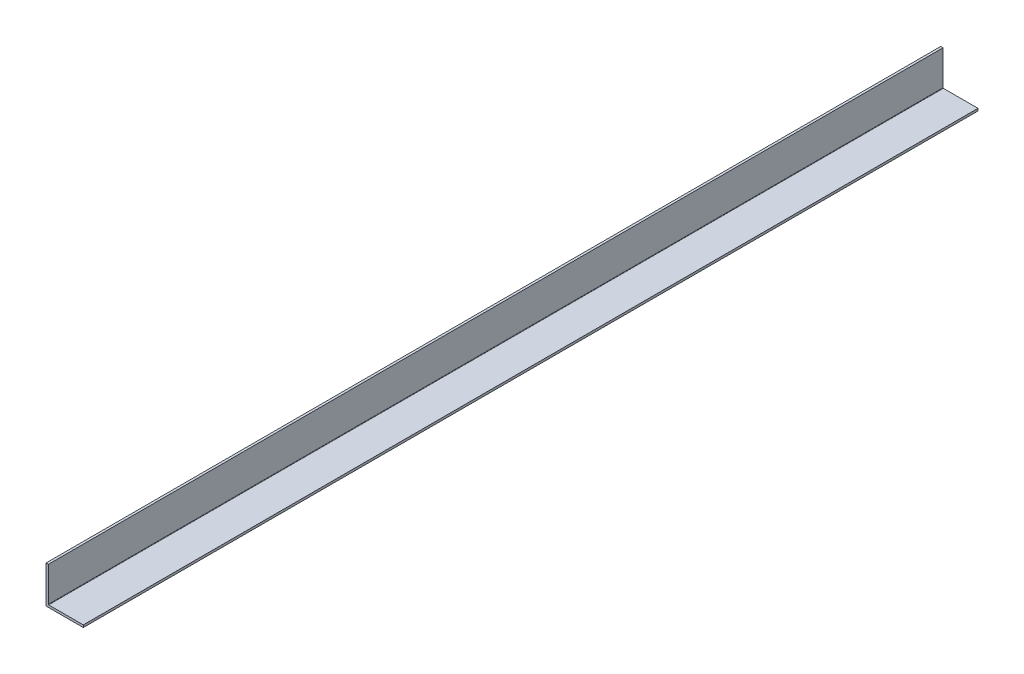
ISO-10303-21;
HEADER;
FILE_DESCRIPTION(('STEP AP214'),'2;1');
FILE_NAME('part.step','',(''),(''),'','','');
FILE_SCHEMA(('AUTOMOTIVE_DESIGN { 1 0 10303 214 1 1 1 1 }'));
ENDSEC;
DATA;
#1=APPLICATION_CONTEXT('core data for automotive mechanical design processes');
#2=APPLICATION_PROTOCOL_DEFINITION('international standard','automotive_design',2000,#1);
#3=PRODUCT_CONTEXT('',#1,'mechanical');
#4=PRODUCT('Part','Part','',(#3));
#5=PRODUCT_RELATED_PRODUCT_CATEGORY('part','',(#4));
#6=PRODUCT_DEFINITION_FORMATION('','',#4);
#7=PRODUCT_DEFINITION_CONTEXT('part definition',#1,'design');
#8=PRODUCT_DEFINITION('design','',#6,#7);
#9=PRODUCT_DEFINITION_SHAPE('','',#8);
#10=(LENGTH_UNIT() NAMED_UNIT(*) SI_UNIT(.MILLI.,.METRE.));
#11=(NAMED_UNIT(*) PLANE_ANGLE_UNIT() SI_UNIT($,.RADIAN.));
#12=(NAMED_UNIT(*) SI_UNIT($,.STERADIAN.) SOLID_ANGLE_UNIT());
#13=UNCERTAINTY_MEASURE_WITH_UNIT(LENGTH_MEASURE(1.E-05),#10,'distance_accuracy_value','');
#14=(GEOMETRIC_REPRESENTATION_CONTEXT(3) GLOBAL_UNCERTAINTY_ASSIGNED_CONTEXT((#13)) GLOBAL_UNIT_ASSIGNED_CONTEXT((#10,
#11,#12)) REPRESENTATION_CONTEXT('',''));
#15=CARTESIAN_POINT('',(0.,0.,0.));
#16=DIRECTION('',(0.,0.,1.));
#17=DIRECTION('',(1.,0.,0.));
#18=AXIS2_PLACEMENT_3D('',#15,#16,#17);
#19=CARTESIAN_POINT('',(1.5875,1.5875,304.8));
#20=DIRECTION('',(-1.,0.,0.));
#21=DIRECTION('',(0.,0.,1.));
#22=AXIS2_PLACEMENT_3D('',#19,#20,#21);
#23=PLANE('',#22);
#24=DIRECTION('',(0.,1.,0.));
#25=VECTOR('',#24,1.);
#26=CARTESIAN_POINT('',(1.5875,1.5875,304.8));
#27=LINE('',#26,#25);
#28=CARTESIAN_POINT('',(1.5875,1.8415,304.8));
#29=VERTEX_POINT('',#28);
#30=CARTESIAN_POINT('',(1.5875,25.4,304.8));
#31=VERTEX_POINT('',#30);
#32=EDGE_CURVE('E100',#29,#31,#27,.T.);
#33=ORIENTED_EDGE('',*,*,#32,.F.);
#34=DIRECTION('',(0.,0.,-1.));
#35=VECTOR('',#34,1.);
#36=CARTESIAN_POINT('',(1.5875,1.8415,-304.8));
#37=LINE('',#36,#35);
#38=CARTESIAN_POINT('',(1.5875,1.8415,-304.8));
#39=VERTEX_POINT('',#38);
#40=EDGE_CURVE('E126',#29,#39,#37,.T.);
#41=ORIENTED_EDGE('',*,*,#40,.T.);
#42=DIRECTION('',(0.,1.,0.));
#43=VECTOR('',#42,1.);
#44=CARTESIAN_POINT('',(1.5875,1.5875,-304.8));
#45=LINE('',#44,#43);
#46=CARTESIAN_POINT('',(1.5875,25.4,-304.8));
#47=VERTEX_POINT('',#46);
#48=EDGE_CURVE('E123',#39,#47,#45,.T.);
#49=ORIENTED_EDGE('',*,*,#48,.T.);
#50=DIRECTION('',(0.,0.,-1.));
#51=VECTOR('',#50,1.);
#52=CARTESIAN_POINT('',(1.5875,25.4,304.8));
#53=LINE('',#52,#51);
#54=EDGE_CURVE('E116',#31,#47,#53,.T.);
#55=ORIENTED_EDGE('',*,*,#54,.F.);
#56=EDGE_LOOP('',(#33,#41,#49,#55));
#57=FACE_BOUND('',#56,.T.);
#58=ADVANCED_FACE('F41',(#57),#23,.F.);
#59=CARTESIAN_POINT('',(1.5875,25.4,304.8));
#60=DIRECTION('',(0.,-1.,0.));
#61=DIRECTION('',(0.,0.,-1.));
#62=AXIS2_PLACEMENT_3D('',#59,#60,#61);
#63=PLANE('',#62);
#64=DIRECTION('',(-1.,0.,0.));
#65=VECTOR('',#64,1.);
#66=CARTESIAN_POINT('',(1.5875,25.4,-304.8));
#67=LINE('',#66,#65);
#68=CARTESIAN_POINT('',(0.,25.4,-304.8));
#69=VERTEX_POINT('',#68);
#70=EDGE_CURVE('E160',#47,#69,#67,.T.);
#71=ORIENTED_EDGE('',*,*,#70,.T.);
#72=DIRECTION('',(0.,0.,-1.));
#73=VECTOR('',#72,1.);
#74=CARTESIAN_POINT('',(0.,25.4,304.8));
#75=LINE('',#74,#73);
#76=CARTESIAN_POINT('',(0.,25.4,304.8));
#77=VERTEX_POINT('',#76);
#78=EDGE_CURVE('E118',#77,#69,#75,.T.);
#79=ORIENTED_EDGE('',*,*,#78,.F.);
#80=DIRECTION('',(-1.,0.,0.));
#81=VECTOR('',#80,1.);
#82=CARTESIAN_POINT('',(1.5875,25.4,304.8));
#83=LINE('',#82,#81);
#84=EDGE_CURVE('E103',#31,#77,#83,.T.);
#85=ORIENTED_EDGE('',*,*,#84,.F.);
#86=ORIENTED_EDGE('',*,*,#54,.T.);
#87=EDGE_LOOP('',(#71,#79,#85,#86));
#88=FACE_BOUND('',#87,.T.);
#89=ADVANCED_FACE('F115',(#88),#63,.F.);
#90=CARTESIAN_POINT('',(0.,25.4,304.8));
#91=DIRECTION('',(1.,0.,0.));
#92=DIRECTION('',(0.,1.,0.));
#93=AXIS2_PLACEMENT_3D('',#90,#91,#92);
#94=PLANE('',#93);
#95=DIRECTION('',(0.,-1.,0.));
#96=VECTOR('',#95,1.);
#97=CARTESIAN_POINT('',(0.,25.4,-304.8));
#98=LINE('',#97,#96);
#99=CARTESIAN_POINT('',(0.,0.,-304.8));
#100=VERTEX_POINT('',#99);
#101=EDGE_CURVE('E157',#69,#100,#98,.T.);
#102=ORIENTED_EDGE('',*,*,#101,.T.);
#103=DIRECTION('',(0.,0.,-1.));
#104=VECTOR('',#103,1.);
#105=CARTESIAN_POINT('',(0.,0.,304.8));
#106=LINE('',#105,#104);
#107=CARTESIAN_POINT('',(0.,0.,304.8));
#108=VERTEX_POINT('',#107);
#109=EDGE_CURVE('E131',#108,#100,#106,.T.);
#110=ORIENTED_EDGE('',*,*,#109,.F.);
#111=DIRECTION('',(0.,-1.,0.));
#112=VECTOR('',#111,1.);
#113=CARTESIAN_POINT('',(0.,25.4,304.8));
#114=LINE('',#113,#112);
#115=EDGE_CURVE('E121',#77,#108,#114,.T.);
#116=ORIENTED_EDGE('',*,*,#115,.F.);
#117=ORIENTED_EDGE('',*,*,#78,.T.);
#118=EDGE_LOOP('',(#102,#110,#116,#117));
#119=FACE_BOUND('',#118,.T.);
#120=ADVANCED_FACE('F178',(#119),#94,.F.);
#121=CARTESIAN_POINT('',(0.,0.,304.8));
#122=DIRECTION('',(0.,1.,0.));
#123=DIRECTION('',(0.,0.,1.));
#124=AXIS2_PLACEMENT_3D('',#121,#122,#123);
#125=PLANE('',#124);
#126=DIRECTION('',(1.,0.,0.));
#127=VECTOR('',#126,1.);
#128=CARTESIAN_POINT('',(0.,0.,-304.8));
#129=LINE('',#128,#127);
#130=CARTESIAN_POINT('',(25.4,0.,-304.8));
#131=VERTEX_POINT('',#130);
#132=EDGE_CURVE('E154',#100,#131,#129,.T.);
#133=ORIENTED_EDGE('',*,*,#132,.T.);
#134=DIRECTION('',(0.,0.,-1.));
#135=VECTOR('',#134,1.);
#136=CARTESIAN_POINT('',(25.4,0.,304.8));
#137=LINE('',#136,#135);
#138=CARTESIAN_POINT('',(25.4,0.,304.8));
#139=VERTEX_POINT('',#138);
#140=EDGE_CURVE('E140',#139,#131,#137,.T.);
#141=ORIENTED_EDGE('',*,*,#140,.F.);
#142=DIRECTION('',(1.,0.,0.));
#143=VECTOR('',#142,1.);
#144=CARTESIAN_POINT('',(0.,0.,304.8));
#145=LINE('',#144,#143);
#146=EDGE_CURVE('E170',#108,#139,#145,.T.);
#147=ORIENTED_EDGE('',*,*,#146,.F.);
#148=ORIENTED_EDGE('',*,*,#109,.T.);
#149=EDGE_LOOP('',(#133,#141,#147,#148));
#150=FACE_BOUND('',#149,.T.);
#151=ADVANCED_FACE('F182',(#150),#125,.F.);
#152=CARTESIAN_POINT('',(25.4,0.,304.8));
#153=DIRECTION('',(-1.,0.,0.));
#154=DIRECTION('',(0.,0.,1.));
#155=AXIS2_PLACEMENT_3D('',#152,#153,#154);
#156=PLANE('',#155);
#157=DIRECTION('',(0.,1.,0.));
#158=VECTOR('',#157,1.);
#159=CARTESIAN_POINT('',(25.4,0.,-304.8));
#160=LINE('',#159,#158);
#161=CARTESIAN_POINT('',(25.4,1.5875,-304.8));
#162=VERTEX_POINT('',#161);
#163=EDGE_CURVE('E151',#131,#162,#160,.T.);
#164=ORIENTED_EDGE('',*,*,#163,.T.);
#165=DIRECTION('',(0.,0.,-1.));
#166=VECTOR('',#165,1.);
#167=CARTESIAN_POINT('',(25.4,1.5875,304.8));
#168=LINE('',#167,#166);
#169=CARTESIAN_POINT('',(25.4,1.5875,304.8));
#170=VERTEX_POINT('',#169);
#171=EDGE_CURVE('E144',#170,#162,#168,.T.);
#172=ORIENTED_EDGE('',*,*,#171,.F.);
#173=DIRECTION('',(0.,1.,0.));
#174=VECTOR('',#173,1.);
#175=CARTESIAN_POINT('',(25.4,0.,304.8));
#176=LINE('',#175,#174);
#177=EDGE_CURVE('E167',#139,#170,#176,.T.);
#178=ORIENTED_EDGE('',*,*,#177,.F.);
#179=ORIENTED_EDGE('',*,*,#140,.T.);
#180=EDGE_LOOP('',(#164,#172,#178,#179));
#181=FACE_BOUND('',#180,.T.);
#182=ADVANCED_FACE('F187',(#181),#156,.F.);
#183=CARTESIAN_POINT('',(25.4,1.5875,304.8));
#184=DIRECTION('',(0.,-1.,0.));
#185=DIRECTION('',(1.,0.,0.));
#186=AXIS2_PLACEMENT_3D('',#183,#184,#185);
#187=PLANE('',#186);
#188=DIRECTION('',(-1.,0.,0.));
#189=VECTOR('',#188,1.);
#190=CARTESIAN_POINT('',(25.4,1.5875,-304.8));
#191=LINE('',#190,#189);
#192=CARTESIAN_POINT('',(1.8415,1.5875,-304.8));
#193=VERTEX_POINT('',#192);
#194=EDGE_CURVE('E111',#162,#193,#191,.T.);
#195=ORIENTED_EDGE('',*,*,#194,.T.);
#196=DIRECTION('',(0.,0.,-1.));
#197=VECTOR('',#196,1.);
#198=CARTESIAN_POINT('',(1.8415,1.5875,304.8));
#199=LINE('',#198,#197);
#200=CARTESIAN_POINT('',(1.8415,1.5875,304.8));
#201=VERTEX_POINT('',#200);
#202=EDGE_CURVE('E57',#193,#201,#199,.F.);
#203=ORIENTED_EDGE('',*,*,#202,.T.);
#204=DIRECTION('',(-1.,0.,0.));
#205=VECTOR('',#204,1.);
#206=CARTESIAN_POINT('',(25.4,1.5875,304.8));
#207=LINE('',#206,#205);
#208=EDGE_CURVE('E148',#170,#201,#207,.T.);
#209=ORIENTED_EDGE('',*,*,#208,.F.);
#210=ORIENTED_EDGE('',*,*,#171,.T.);
#211=EDGE_LOOP('',(#195,#203,#209,#210));
#212=FACE_BOUND('',#211,.T.);
#213=ADVANCED_FACE('F190',(#212),#187,.F.);
#214=CARTESIAN_POINT('',(0.,0.,304.8));
#215=DIRECTION('',(0.,0.,1.));
#216=DIRECTION('',(1.,0.,0.));
#217=AXIS2_PLACEMENT_3D('',#214,#215,#216);
#218=PLANE('',#217);
#219=ORIENTED_EDGE('',*,*,#208,.T.);
#220=CARTESIAN_POINT('',(1.8415,1.8415,304.8));
#221=DIRECTION('',(0.,0.,1.));
#222=DIRECTION('',(1.,0.,0.));
#223=AXIS2_PLACEMENT_3D('',#220,#221,#222);
#224=CIRCLE('',#223,0.254);
#225=EDGE_CURVE('E11',#201,#29,#224,.F.);
#226=ORIENTED_EDGE('',*,*,#225,.T.);
#227=ORIENTED_EDGE('',*,*,#32,.T.);
#228=ORIENTED_EDGE('',*,*,#84,.T.);
#229=ORIENTED_EDGE('',*,*,#115,.T.);
#230=ORIENTED_EDGE('',*,*,#146,.T.);
#231=ORIENTED_EDGE('',*,*,#177,.T.);
#232=EDGE_LOOP('',(#219,#226,#227,#228,#229,#230,#231));
#233=FACE_BOUND('',#232,.T.);
#234=ADVANCED_FACE('F102',(#233),#218,.T.);
#235=CARTESIAN_POINT('',(0.,0.,-304.8));
#236=DIRECTION('',(0.,0.,1.));
#237=DIRECTION('',(1.,0.,0.));
#238=AXIS2_PLACEMENT_3D('',#235,#236,#237);
#239=PLANE('',#238);
#240=ORIENTED_EDGE('',*,*,#48,.F.);
#241=CARTESIAN_POINT('',(1.8415,1.8415,-304.8));
#242=DIRECTION('',(0.,0.,1.));
#243=DIRECTION('',(1.,0.,0.));
#244=AXIS2_PLACEMENT_3D('',#241,#242,#243);
#245=CIRCLE('',#244,0.254);
#246=EDGE_CURVE('E50',#39,#193,#245,.T.);
#247=ORIENTED_EDGE('',*,*,#246,.T.);
#248=ORIENTED_EDGE('',*,*,#194,.F.);
#249=ORIENTED_EDGE('',*,*,#163,.F.);
#250=ORIENTED_EDGE('',*,*,#132,.F.);
#251=ORIENTED_EDGE('',*,*,#101,.F.);
#252=ORIENTED_EDGE('',*,*,#70,.F.);
#253=EDGE_LOOP('',(#240,#247,#248,#249,#250,#251,#252));
#254=FACE_BOUND('',#253,.T.);
#255=ADVANCED_FACE('F189',(#254),#239,.F.);
#256=CARTESIAN_POINT('',(1.8415,1.8415,304.8));
#257=DIRECTION('',(0.,0.,1.));
#258=DIRECTION('',(1.,0.,0.));
#259=AXIS2_PLACEMENT_3D('',#256,#257,#258);
#260=CYLINDRICAL_SURFACE('',#259,0.254);
#261=ORIENTED_EDGE('',*,*,#225,.F.);
#262=ORIENTED_EDGE('',*,*,#202,.F.);
#263=ORIENTED_EDGE('',*,*,#246,.F.);
#264=ORIENTED_EDGE('',*,*,#40,.F.);
#265=EDGE_LOOP('',(#261,#262,#263,#264));
#266=FACE_BOUND('',#265,.T.);
#267=ADVANCED_FACE('F43',(#266),#260,.F.);
#268=CLOSED_SHELL('',(#58,#89,#120,#151,#182,#213,#234,#255,#267));
#269=MANIFOLD_SOLID_BREP('B2',#268);
#270=ADVANCED_BREP_SHAPE_REPRESENTATION('',(#18,#269),#14);
#271=SHAPE_DEFINITION_REPRESENTATION(#9,#270);
ENDSEC;
END-ISO-10303-21;
